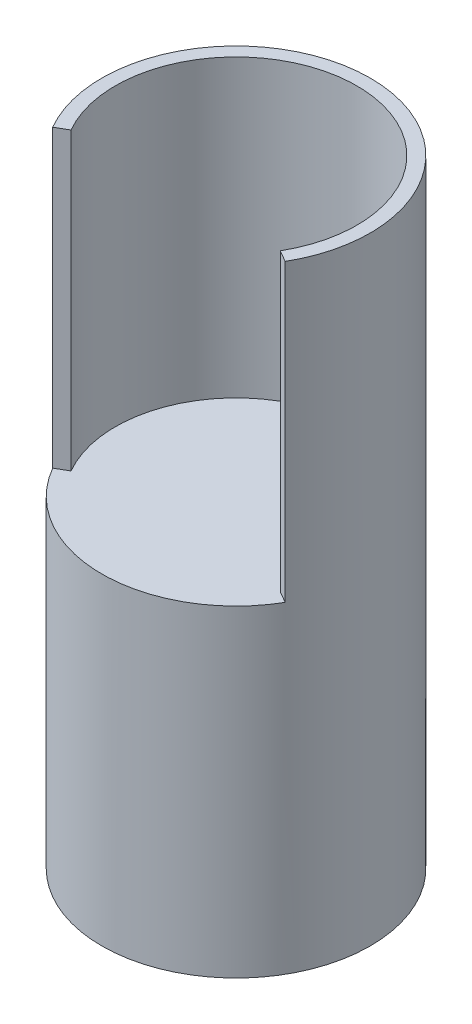
ISO-10303-21;
HEADER;
FILE_DESCRIPTION(('STEP AP214'),'2;1');
FILE_NAME('part.step','',(''),(''),'','','');
FILE_SCHEMA(('AUTOMOTIVE_DESIGN { 1 0 10303 214 1 1 1 1 }'));
ENDSEC;
DATA;
#1=APPLICATION_CONTEXT('core data for automotive mechanical design processes');
#2=APPLICATION_PROTOCOL_DEFINITION('international standard','automotive_design',2000,#1);
#3=PRODUCT_CONTEXT('',#1,'mechanical');
#4=PRODUCT('Part','Part','',(#3));
#5=PRODUCT_RELATED_PRODUCT_CATEGORY('part','',(#4));
#6=PRODUCT_DEFINITION_FORMATION('','',#4);
#7=PRODUCT_DEFINITION_CONTEXT('part definition',#1,'design');
#8=PRODUCT_DEFINITION('design','',#6,#7);
#9=PRODUCT_DEFINITION_SHAPE('','',#8);
#10=(LENGTH_UNIT() NAMED_UNIT(*) SI_UNIT(.MILLI.,.METRE.));
#11=(NAMED_UNIT(*) PLANE_ANGLE_UNIT() SI_UNIT($,.RADIAN.));
#12=(NAMED_UNIT(*) SI_UNIT($,.STERADIAN.) SOLID_ANGLE_UNIT());
#13=UNCERTAINTY_MEASURE_WITH_UNIT(LENGTH_MEASURE(1.E-05),#10,'distance_accuracy_value','');
#14=(GEOMETRIC_REPRESENTATION_CONTEXT(3) GLOBAL_UNCERTAINTY_ASSIGNED_CONTEXT((#13)) GLOBAL_UNIT_ASSIGNED_CONTEXT((#10,
#11,#12)) REPRESENTATION_CONTEXT('',''));
#15=CARTESIAN_POINT('',(0.,0.,0.));
#16=DIRECTION('',(0.,0.,1.));
#17=DIRECTION('',(1.,0.,0.));
#18=AXIS2_PLACEMENT_3D('',#15,#16,#17);
#19=CARTESIAN_POINT('',(0.,152.4,0.));
#20=DIRECTION('',(0.,-1.,0.));
#21=DIRECTION('',(0.,0.,-1.));
#22=AXIS2_PLACEMENT_3D('',#19,#20,#21);
#23=CYLINDRICAL_SURFACE('',#22,63.5);
#24=CARTESIAN_POINT('',(0.,152.4,0.));
#25=DIRECTION('',(0.,1.,0.));
#26=DIRECTION('',(0.,0.,1.));
#27=AXIS2_PLACEMENT_3D('',#24,#25,#26);
#28=CIRCLE('',#27,63.5);
#29=CARTESIAN_POINT('',(-54.9926131403119,152.4,31.7499999999999));
#30=VERTEX_POINT('',#29);
#31=CARTESIAN_POINT('',(54.9926131403117,152.4,31.7500000000003));
#32=VERTEX_POINT('',#31);
#33=EDGE_CURVE('E11',#30,#32,#28,.T.);
#34=ORIENTED_EDGE('',*,*,#33,.F.);
#35=DIRECTION('',(0.,-1.,0.));
#36=VECTOR('',#35,1.);
#37=CARTESIAN_POINT('',(-54.9926131403119,292.1,31.7499999999999));
#38=LINE('',#37,#36);
#39=CARTESIAN_POINT('',(-54.9926131403119,292.1,31.7499999999999));
#40=VERTEX_POINT('',#39);
#41=EDGE_CURVE('E81',#40,#30,#38,.T.);
#42=ORIENTED_EDGE('',*,*,#41,.F.);
#43=CARTESIAN_POINT('',(0.,292.1,0.));
#44=DIRECTION('',(0.,1.,0.));
#45=DIRECTION('',(0.,0.,-1.));
#46=AXIS2_PLACEMENT_3D('',#43,#44,#45);
#47=CIRCLE('',#46,63.5);
#48=CARTESIAN_POINT('',(54.9926131403117,292.1,31.7500000000003));
#49=VERTEX_POINT('',#48);
#50=EDGE_CURVE('E87',#49,#40,#47,.T.);
#51=ORIENTED_EDGE('',*,*,#50,.F.);
#52=DIRECTION('',(0.,-1.,0.));
#53=VECTOR('',#52,1.);
#54=CARTESIAN_POINT('',(54.9926131403117,292.1,31.7500000000003));
#55=LINE('',#54,#53);
#56=EDGE_CURVE('E105',#49,#32,#55,.T.);
#57=ORIENTED_EDGE('',*,*,#56,.T.);
#58=EDGE_LOOP('',(#34,#42,#51,#57));
#59=FACE_BOUND('',#58,.T.);
#60=CARTESIAN_POINT('',(0.,0.,0.));
#61=DIRECTION('',(0.,1.,0.));
#62=DIRECTION('',(0.,0.,1.));
#63=AXIS2_PLACEMENT_3D('',#60,#61,#62);
#64=CIRCLE('',#63,63.5);
#65=CARTESIAN_POINT('',(0.,0.,63.5));
#66=VERTEX_POINT('',#65);
#67=EDGE_CURVE('E42',#66,#66,#64,.T.);
#68=ORIENTED_EDGE('',*,*,#67,.T.);
#69=EDGE_LOOP('',(#68));
#70=FACE_BOUND('',#69,.T.);
#71=ADVANCED_FACE('F39',(#59,#70),#23,.T.);
#72=CARTESIAN_POINT('',(0.,152.4,0.));
#73=DIRECTION('',(0.,1.,0.));
#74=DIRECTION('',(0.,0.,1.));
#75=AXIS2_PLACEMENT_3D('',#72,#73,#74);
#76=PLANE('',#75);
#77=DIRECTION('',(0.866025403784435,0.,0.500000000000005));
#78=VECTOR('',#77,1.);
#79=CARTESIAN_POINT('',(49.4933518262805,152.4,28.5750000000002));
#80=LINE('',#79,#78);
#81=CARTESIAN_POINT('',(49.4933518262805,152.4,28.5750000000002));
#82=VERTEX_POINT('',#81);
#83=EDGE_CURVE('E52',#82,#32,#80,.T.);
#84=ORIENTED_EDGE('',*,*,#83,.F.);
#85=CARTESIAN_POINT('',(0.,152.4,0.));
#86=DIRECTION('',(0.,-1.,0.));
#87=DIRECTION('',(0.,0.,-1.));
#88=AXIS2_PLACEMENT_3D('',#85,#86,#87);
#89=CIRCLE('',#88,57.15);
#90=CARTESIAN_POINT('',(-49.4933518262807,152.4,28.5749999999999));
#91=VERTEX_POINT('',#90);
#92=EDGE_CURVE('E108',#91,#82,#89,.T.);
#93=ORIENTED_EDGE('',*,*,#92,.F.);
#94=DIRECTION('',(0.86602540378444,0.,-0.499999999999998));
#95=VECTOR('',#94,1.);
#96=CARTESIAN_POINT('',(-54.9926131403119,152.4,31.7499999999999));
#97=LINE('',#96,#95);
#98=EDGE_CURVE('E57',#30,#91,#97,.T.);
#99=ORIENTED_EDGE('',*,*,#98,.F.);
#100=ORIENTED_EDGE('',*,*,#33,.T.);
#101=EDGE_LOOP('',(#84,#93,#99,#100));
#102=FACE_BOUND('',#101,.T.);
#103=ADVANCED_FACE('F126',(#102),#76,.T.);
#104=CARTESIAN_POINT('',(0.,0.,0.));
#105=DIRECTION('',(0.,1.,0.));
#106=DIRECTION('',(0.,0.,1.));
#107=AXIS2_PLACEMENT_3D('',#104,#105,#106);
#108=PLANE('',#107);
#109=ORIENTED_EDGE('',*,*,#67,.F.);
#110=EDGE_LOOP('',(#109));
#111=FACE_BOUND('',#110,.T.);
#112=ADVANCED_FACE('F131',(#111),#108,.F.);
#113=CARTESIAN_POINT('',(-54.9926131403119,292.1,31.7499999999999));
#114=DIRECTION('',(-0.499999999999998,0.,-0.86602540378444));
#115=DIRECTION('',(-0.86602540378444,0.,0.499999999999998));
#116=AXIS2_PLACEMENT_3D('',#113,#114,#115);
#117=PLANE('',#116);
#118=ORIENTED_EDGE('',*,*,#98,.T.);
#119=DIRECTION('',(0.,-1.,0.));
#120=VECTOR('',#119,1.);
#121=CARTESIAN_POINT('',(-49.4933518262807,292.1,28.5749999999999));
#122=LINE('',#121,#120);
#123=CARTESIAN_POINT('',(-49.4933518262807,292.1,28.5749999999999));
#124=VERTEX_POINT('',#123);
#125=EDGE_CURVE('E83',#124,#91,#122,.T.);
#126=ORIENTED_EDGE('',*,*,#125,.F.);
#127=DIRECTION('',(0.86602540378444,0.,-0.499999999999998));
#128=VECTOR('',#127,1.);
#129=CARTESIAN_POINT('',(-54.9926131403119,292.1,31.7499999999999));
#130=LINE('',#129,#128);
#131=EDGE_CURVE('E77',#40,#124,#130,.T.);
#132=ORIENTED_EDGE('',*,*,#131,.F.);
#133=ORIENTED_EDGE('',*,*,#41,.T.);
#134=EDGE_LOOP('',(#118,#126,#132,#133));
#135=FACE_BOUND('',#134,.T.);
#136=ADVANCED_FACE('F79',(#135),#117,.F.);
#137=CARTESIAN_POINT('',(0.,292.1,0.));
#138=DIRECTION('',(0.,-1.,0.));
#139=DIRECTION('',(0.,0.,-1.));
#140=AXIS2_PLACEMENT_3D('',#137,#138,#139);
#141=CYLINDRICAL_SURFACE('',#140,57.15);
#142=ORIENTED_EDGE('',*,*,#92,.T.);
#143=DIRECTION('',(0.,-1.,0.));
#144=VECTOR('',#143,1.);
#145=CARTESIAN_POINT('',(49.4933518262805,292.1,28.5750000000002));
#146=LINE('',#145,#144);
#147=CARTESIAN_POINT('',(49.4933518262805,292.1,28.5750000000002));
#148=VERTEX_POINT('',#147);
#149=EDGE_CURVE('E100',#148,#82,#146,.T.);
#150=ORIENTED_EDGE('',*,*,#149,.F.);
#151=CARTESIAN_POINT('',(0.,292.1,0.));
#152=DIRECTION('',(0.,-1.,0.));
#153=DIRECTION('',(0.,0.,-1.));
#154=AXIS2_PLACEMENT_3D('',#151,#152,#153);
#155=CIRCLE('',#154,57.15);
#156=EDGE_CURVE('E86',#124,#148,#155,.T.);
#157=ORIENTED_EDGE('',*,*,#156,.F.);
#158=ORIENTED_EDGE('',*,*,#125,.T.);
#159=EDGE_LOOP('',(#142,#150,#157,#158));
#160=FACE_BOUND('',#159,.T.);
#161=ADVANCED_FACE('F114',(#160),#141,.F.);
#162=CARTESIAN_POINT('',(49.4933518262805,292.1,28.5750000000002));
#163=DIRECTION('',(0.500000000000005,0.,-0.866025403784435));
#164=DIRECTION('',(-0.866025403784435,0.,-0.500000000000005));
#165=AXIS2_PLACEMENT_3D('',#162,#163,#164);
#166=PLANE('',#165);
#167=ORIENTED_EDGE('',*,*,#83,.T.);
#168=ORIENTED_EDGE('',*,*,#56,.F.);
#169=DIRECTION('',(0.866025403784435,0.,0.500000000000005));
#170=VECTOR('',#169,1.);
#171=CARTESIAN_POINT('',(49.4933518262805,292.1,28.5750000000002));
#172=LINE('',#171,#170);
#173=EDGE_CURVE('E92',#148,#49,#172,.T.);
#174=ORIENTED_EDGE('',*,*,#173,.F.);
#175=ORIENTED_EDGE('',*,*,#149,.T.);
#176=EDGE_LOOP('',(#167,#168,#174,#175));
#177=FACE_BOUND('',#176,.T.);
#178=ADVANCED_FACE('F116',(#177),#166,.F.);
#179=CARTESIAN_POINT('',(0.,292.1,0.));
#180=DIRECTION('',(0.,-1.,0.));
#181=DIRECTION('',(0.,0.,-1.));
#182=AXIS2_PLACEMENT_3D('',#179,#180,#181);
#183=PLANE('',#182);
#184=ORIENTED_EDGE('',*,*,#50,.T.);
#185=ORIENTED_EDGE('',*,*,#131,.T.);
#186=ORIENTED_EDGE('',*,*,#156,.T.);
#187=ORIENTED_EDGE('',*,*,#173,.T.);
#188=EDGE_LOOP('',(#184,#185,#186,#187));
#189=FACE_BOUND('',#188,.T.);
#190=ADVANCED_FACE('F90',(#189),#183,.F.);
#191=CLOSED_SHELL('',(#71,#103,#112,#136,#161,#178,#190));
#192=MANIFOLD_SOLID_BREP('B2',#191);
#193=ADVANCED_BREP_SHAPE_REPRESENTATION('',(#18,#192),#14);
#194=SHAPE_DEFINITION_REPRESENTATION(#9,#193);
ENDSEC;
END-ISO-10303-21;
